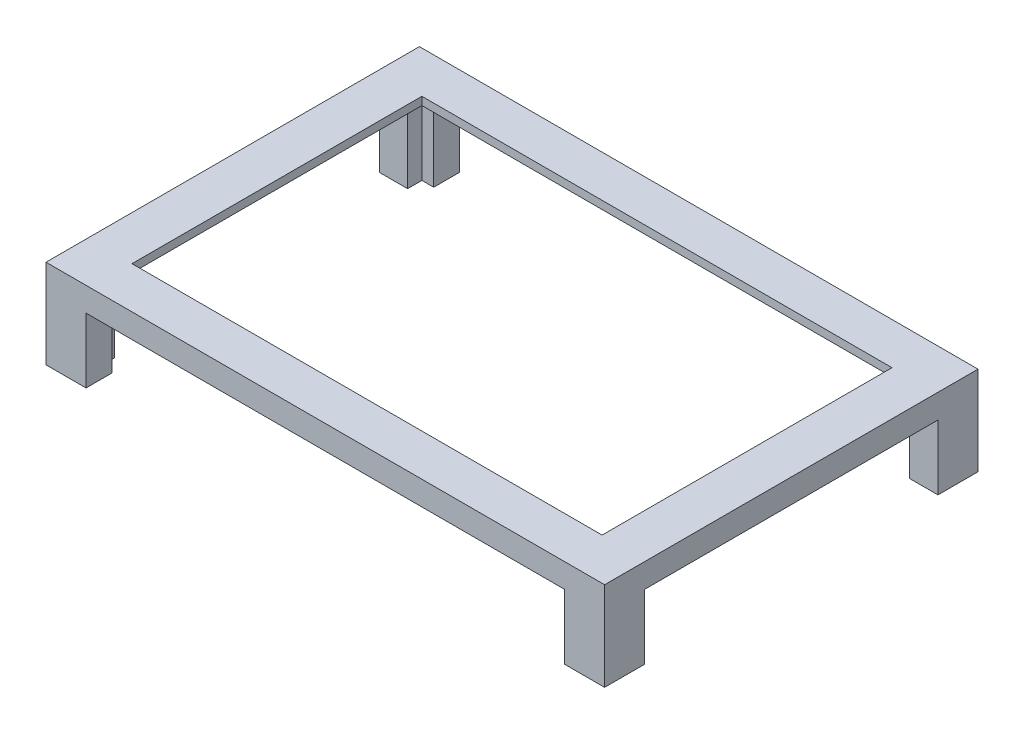
ISO-10303-21;
HEADER;
FILE_DESCRIPTION(('STEP AP214'),'2;1');
FILE_NAME('part.step','',(''),(''),'','','');
FILE_SCHEMA(('AUTOMOTIVE_DESIGN { 1 0 10303 214 1 1 1 1 }'));
ENDSEC;
DATA;
#1=APPLICATION_CONTEXT('core data for automotive mechanical design processes');
#2=APPLICATION_PROTOCOL_DEFINITION('international standard','automotive_design',2000,#1);
#3=PRODUCT_CONTEXT('',#1,'mechanical');
#4=PRODUCT('Part','Part','',(#3));
#5=PRODUCT_RELATED_PRODUCT_CATEGORY('part','',(#4));
#6=PRODUCT_DEFINITION_FORMATION('','',#4);
#7=PRODUCT_DEFINITION_CONTEXT('part definition',#1,'design');
#8=PRODUCT_DEFINITION('design','',#6,#7);
#9=PRODUCT_DEFINITION_SHAPE('','',#8);
#10=(LENGTH_UNIT() NAMED_UNIT(*) SI_UNIT(.MILLI.,.METRE.));
#11=(NAMED_UNIT(*) PLANE_ANGLE_UNIT() SI_UNIT($,.RADIAN.));
#12=(NAMED_UNIT(*) SI_UNIT($,.STERADIAN.) SOLID_ANGLE_UNIT());
#13=UNCERTAINTY_MEASURE_WITH_UNIT(LENGTH_MEASURE(1.E-05),#10,'distance_accuracy_value','');
#14=(GEOMETRIC_REPRESENTATION_CONTEXT(3) GLOBAL_UNCERTAINTY_ASSIGNED_CONTEXT((#13)) GLOBAL_UNIT_ASSIGNED_CONTEXT((#10,
#11,#12)) REPRESENTATION_CONTEXT('',''));
#15=CARTESIAN_POINT('',(0.,0.,0.));
#16=DIRECTION('',(0.,0.,1.));
#17=DIRECTION('',(1.,0.,0.));
#18=AXIS2_PLACEMENT_3D('',#15,#16,#17);
#19=CARTESIAN_POINT('',(0.,-28.194,0.));
#20=DIRECTION('',(0.,1.,0.));
#21=DIRECTION('',(0.,0.,1.));
#22=AXIS2_PLACEMENT_3D('',#19,#20,#21);
#23=PLANE('',#22);
#24=CARTESIAN_POINT('',(-4.8895,-28.194,-4.92125000000003));
#25=DIRECTION('',(0.,-1.,0.));
#26=DIRECTION('',(0.,0.,-1.));
#27=AXIS2_PLACEMENT_3D('',#24,#25,#26);
#28=CIRCLE('',#27,1.37795);
#29=CARTESIAN_POINT('',(-4.8895,-28.194,-6.29920000000003));
#30=VERTEX_POINT('',#29);
#31=EDGE_CURVE('E546',#30,#30,#28,.T.);
#32=ORIENTED_EDGE('',*,*,#31,.F.);
#33=EDGE_LOOP('',(#32));
#34=FACE_BOUND('',#33,.T.);
#35=DIRECTION('',(-1.,0.,0.));
#36=VECTOR('',#35,1.);
#37=CARTESIAN_POINT('',(0.,-28.194,-8.41375000000003));
#38=LINE('',#37,#36);
#39=CARTESIAN_POINT('',(3.4925,-28.194,-8.41375000000005));
#40=VERTEX_POINT('',#39);
#41=CARTESIAN_POINT('',(-9.2075,-28.194,-8.41375000000003));
#42=VERTEX_POINT('',#41);
#43=EDGE_CURVE('E260',#40,#42,#38,.T.);
#44=ORIENTED_EDGE('',*,*,#43,.F.);
#45=DIRECTION('',(0.,0.,1.));
#46=VECTOR('',#45,1.);
#47=CARTESIAN_POINT('',(3.4925,-28.194,-88.6142500000001));
#48=LINE('',#47,#46);
#49=CARTESIAN_POINT('',(3.4925,-28.194,-0.254000000000032));
#50=VERTEX_POINT('',#49);
#51=EDGE_CURVE('E354',#40,#50,#48,.T.);
#52=ORIENTED_EDGE('',*,*,#51,.T.);
#53=DIRECTION('',(1.,0.,0.));
#54=VECTOR('',#53,1.);
#55=CARTESIAN_POINT('',(0.,-28.194,-0.254));
#56=LINE('',#55,#54);
#57=CARTESIAN_POINT('',(-0.254,-28.194,-0.254));
#58=VERTEX_POINT('',#57);
#59=EDGE_CURVE('E265',#58,#50,#56,.T.);
#60=ORIENTED_EDGE('',*,*,#59,.F.);
#61=DIRECTION('',(0.,0.,1.));
#62=VECTOR('',#61,1.);
#63=CARTESIAN_POINT('',(-0.254,-28.194,0.));
#64=LINE('',#63,#62);
#65=CARTESIAN_POINT('',(-0.253999999999949,-28.194,4.28624999999997));
#66=VERTEX_POINT('',#65);
#67=EDGE_CURVE('E275',#58,#66,#64,.T.);
#68=ORIENTED_EDGE('',*,*,#67,.T.);
#69=DIRECTION('',(-1.,0.,0.));
#70=VECTOR('',#69,1.);
#71=CARTESIAN_POINT('',(0.,-28.194,4.28624999999997));
#72=LINE('',#71,#70);
#73=CARTESIAN_POINT('',(-9.2075,-28.194,4.28624999999997));
#74=VERTEX_POINT('',#73);
#75=EDGE_CURVE('E313',#66,#74,#72,.T.);
#76=ORIENTED_EDGE('',*,*,#75,.T.);
#77=DIRECTION('',(0.,0.,-1.));
#78=VECTOR('',#77,1.);
#79=CARTESIAN_POINT('',(-9.2075,-28.194,0.));
#80=LINE('',#79,#78);
#81=EDGE_CURVE('E253',#74,#42,#80,.T.);
#82=ORIENTED_EDGE('',*,*,#81,.T.);
#83=EDGE_LOOP('',(#44,#52,#60,#68,#76,#82));
#84=FACE_BOUND('',#83,.T.);
#85=ADVANCED_FACE('F39',(#34,#84),#23,.F.);
#86=CARTESIAN_POINT('',(-4.8895,-28.194,106.58475));
#87=DIRECTION('',(0.,-1.,0.));
#88=DIRECTION('',(0.,0.,-1.));
#89=AXIS2_PLACEMENT_3D('',#86,#87,#88);
#90=CIRCLE('',#89,1.37795);
#91=CARTESIAN_POINT('',(-4.8895,-28.194,105.2068));
#92=VERTEX_POINT('',#91);
#93=EDGE_CURVE('E549',#92,#92,#90,.T.);
#94=ORIENTED_EDGE('',*,*,#93,.F.);
#95=EDGE_LOOP('',(#94));
#96=FACE_BOUND('',#95,.T.);
#97=DIRECTION('',(1.,0.,0.));
#98=VECTOR('',#97,1.);
#99=CARTESIAN_POINT('',(0.,-28.194,101.854));
#100=LINE('',#99,#98);
#101=CARTESIAN_POINT('',(-0.254,-28.194,101.854));
#102=VERTEX_POINT('',#101);
#103=CARTESIAN_POINT('',(3.4925,-28.194,101.854));
#104=VERTEX_POINT('',#103);
#105=EDGE_CURVE('E243',#102,#104,#100,.T.);
#106=ORIENTED_EDGE('',*,*,#105,.T.);
#107=DIRECTION('',(0.,0.,1.));
#108=VECTOR('',#107,1.);
#109=CARTESIAN_POINT('',(3.4925,-28.194,0.));
#110=LINE('',#109,#108);
#111=CARTESIAN_POINT('',(3.4925,-28.194,110.01375));
#112=VERTEX_POINT('',#111);
#113=EDGE_CURVE('E11',#104,#112,#110,.T.);
#114=ORIENTED_EDGE('',*,*,#113,.T.);
#115=DIRECTION('',(-1.,0.,0.));
#116=VECTOR('',#115,1.);
#117=CARTESIAN_POINT('',(0.,-28.194,110.01375));
#118=LINE('',#117,#116);
#119=CARTESIAN_POINT('',(-9.2075,-28.194,110.01375));
#120=VERTEX_POINT('',#119);
#121=EDGE_CURVE('E240',#112,#120,#118,.T.);
#122=ORIENTED_EDGE('',*,*,#121,.T.);
#123=CARTESIAN_POINT('',(-9.2075,-28.194,97.31375));
#124=VERTEX_POINT('',#123);
#125=EDGE_CURVE('E249',#120,#124,#80,.T.);
#126=ORIENTED_EDGE('',*,*,#125,.T.);
#127=DIRECTION('',(1.,0.,0.));
#128=VECTOR('',#127,1.);
#129=CARTESIAN_POINT('',(0.,-28.194,97.31375));
#130=LINE('',#129,#128);
#131=CARTESIAN_POINT('',(-0.254,-28.194,97.31375));
#132=VERTEX_POINT('',#131);
#133=EDGE_CURVE('E312',#124,#132,#130,.T.);
#134=ORIENTED_EDGE('',*,*,#133,.T.);
#135=EDGE_CURVE('E274',#132,#102,#64,.T.);
#136=ORIENTED_EDGE('',*,*,#135,.T.);
#137=EDGE_LOOP('',(#106,#114,#122,#126,#134,#136));
#138=FACE_BOUND('',#137,.T.);
#139=ADVANCED_FACE('F238',(#96,#138),#23,.F.);
#140=CARTESIAN_POINT('',(163.7665,-28.194,-4.92125000000003));
#141=DIRECTION('',(0.,-1.,0.));
#142=DIRECTION('',(0.,0.,-1.));
#143=AXIS2_PLACEMENT_3D('',#140,#141,#142);
#144=CIRCLE('',#143,1.37795);
#145=CARTESIAN_POINT('',(163.7665,-28.194,-6.29920000000003));
#146=VERTEX_POINT('',#145);
#147=EDGE_CURVE('E540',#146,#146,#144,.T.);
#148=ORIENTED_EDGE('',*,*,#147,.F.);
#149=EDGE_LOOP('',(#148));
#150=FACE_BOUND('',#149,.T.);
#151=CARTESIAN_POINT('',(155.2575,-28.194,-0.254000000000032));
#152=VERTEX_POINT('',#151);
#153=CARTESIAN_POINT('',(159.004,-28.194,-0.254));
#154=VERTEX_POINT('',#153);
#155=EDGE_CURVE('E264',#152,#154,#56,.T.);
#156=ORIENTED_EDGE('',*,*,#155,.F.);
#157=DIRECTION('',(0.,0.,1.));
#158=VECTOR('',#157,1.);
#159=CARTESIAN_POINT('',(155.2575,-28.194,-88.6142500000001));
#160=LINE('',#159,#158);
#161=CARTESIAN_POINT('',(155.2575,-28.194,-8.41375000000005));
#162=VERTEX_POINT('',#161);
#163=EDGE_CURVE('E362',#162,#152,#160,.T.);
#164=ORIENTED_EDGE('',*,*,#163,.F.);
#165=CARTESIAN_POINT('',(167.9575,-28.194,-8.41375000000003));
#166=VERTEX_POINT('',#165);
#167=EDGE_CURVE('E261',#166,#162,#38,.T.);
#168=ORIENTED_EDGE('',*,*,#167,.F.);
#169=DIRECTION('',(0.,0.,-1.));
#170=VECTOR('',#169,1.);
#171=CARTESIAN_POINT('',(167.9575,-28.194,0.));
#172=LINE('',#171,#170);
#173=CARTESIAN_POINT('',(167.9575,-28.194,4.28624999999997));
#174=VERTEX_POINT('',#173);
#175=EDGE_CURVE('E252',#174,#166,#172,.T.);
#176=ORIENTED_EDGE('',*,*,#175,.F.);
#177=CARTESIAN_POINT('',(159.004,-28.194,4.28624999999997));
#178=VERTEX_POINT('',#177);
#179=EDGE_CURVE('E316',#174,#178,#72,.T.);
#180=ORIENTED_EDGE('',*,*,#179,.T.);
#181=DIRECTION('',(0.,0.,1.));
#182=VECTOR('',#181,1.);
#183=CARTESIAN_POINT('',(159.004,-28.194,0.));
#184=LINE('',#183,#182);
#185=EDGE_CURVE('E269',#154,#178,#184,.T.);
#186=ORIENTED_EDGE('',*,*,#185,.F.);
#187=EDGE_LOOP('',(#156,#164,#168,#176,#180,#186));
#188=FACE_BOUND('',#187,.T.);
#189=ADVANCED_FACE('F480',(#150,#188),#23,.F.);
#190=CARTESIAN_POINT('',(159.004,-28.194,0.));
#191=DIRECTION('',(-1.,0.,0.));
#192=DIRECTION('',(0.,0.,1.));
#193=AXIS2_PLACEMENT_3D('',#190,#191,#192);
#194=PLANE('',#193);
#195=DIRECTION('',(0.,-1.,0.));
#196=VECTOR('',#195,1.);
#197=CARTESIAN_POINT('',(159.004,-28.194,4.28624999999997));
#198=LINE('',#197,#196);
#199=CARTESIAN_POINT('',(159.004,-7.62,4.28624999999997));
#200=VERTEX_POINT('',#199);
#201=EDGE_CURVE('E407',#200,#178,#198,.T.);
#202=ORIENTED_EDGE('',*,*,#201,.F.);
#203=DIRECTION('',(0.,0.,-1.));
#204=VECTOR('',#203,1.);
#205=CARTESIAN_POINT('',(159.004,-7.62,0.));
#206=LINE('',#205,#204);
#207=CARTESIAN_POINT('',(159.004,-7.62,97.31375));
#208=VERTEX_POINT('',#207);
#209=EDGE_CURVE('E412',#208,#200,#206,.T.);
#210=ORIENTED_EDGE('',*,*,#209,.F.);
#211=DIRECTION('',(0.,1.,0.));
#212=VECTOR('',#211,1.);
#213=CARTESIAN_POINT('',(159.004,-28.194,97.31375));
#214=LINE('',#213,#212);
#215=CARTESIAN_POINT('',(159.004,-28.194,97.31375));
#216=VERTEX_POINT('',#215);
#217=EDGE_CURVE('E342',#216,#208,#214,.T.);
#218=ORIENTED_EDGE('',*,*,#217,.F.);
#219=CARTESIAN_POINT('',(159.004,-28.194,101.854));
#220=VERTEX_POINT('',#219);
#221=EDGE_CURVE('E268',#216,#220,#184,.T.);
#222=ORIENTED_EDGE('',*,*,#221,.T.);
#223=DIRECTION('',(0.,1.,0.));
#224=VECTOR('',#223,1.);
#225=CARTESIAN_POINT('',(159.004,-28.194,101.854));
#226=LINE('',#225,#224);
#227=CARTESIAN_POINT('',(159.004,-2.54,101.854));
#228=VERTEX_POINT('',#227);
#229=EDGE_CURVE('E297',#220,#228,#226,.T.);
#230=ORIENTED_EDGE('',*,*,#229,.T.);
#231=DIRECTION('',(0.,0.,-1.));
#232=VECTOR('',#231,1.);
#233=CARTESIAN_POINT('',(159.004,-2.54,4.826));
#234=LINE('',#233,#232);
#235=CARTESIAN_POINT('',(159.004,-2.54,-0.254));
#236=VERTEX_POINT('',#235);
#237=EDGE_CURVE('E339',#228,#236,#234,.T.);
#238=ORIENTED_EDGE('',*,*,#237,.T.);
#239=DIRECTION('',(0.,1.,0.));
#240=VECTOR('',#239,1.);
#241=CARTESIAN_POINT('',(159.004,-28.194,-0.254));
#242=LINE('',#241,#240);
#243=EDGE_CURVE('E300',#154,#236,#242,.T.);
#244=ORIENTED_EDGE('',*,*,#243,.F.);
#245=ORIENTED_EDGE('',*,*,#185,.T.);
#246=EDGE_LOOP('',(#202,#210,#218,#222,#230,#238,#244,#245));
#247=FACE_BOUND('',#246,.T.);
#248=ADVANCED_FACE('F337',(#247),#194,.T.);
#249=CARTESIAN_POINT('',(0.,-28.194,101.854));
#250=DIRECTION('',(0.,0.,1.));
#251=DIRECTION('',(1.,0.,0.));
#252=AXIS2_PLACEMENT_3D('',#249,#250,#251);
#253=PLANE('',#252);
#254=DIRECTION('',(-1.,0.,0.));
#255=VECTOR('',#254,1.);
#256=CARTESIAN_POINT('',(0.,-7.62,101.854));
#257=LINE('',#256,#255);
#258=CARTESIAN_POINT('',(155.2575,-7.62,101.854));
#259=VERTEX_POINT('',#258);
#260=CARTESIAN_POINT('',(3.4925,-7.62,101.854));
#261=VERTEX_POINT('',#260);
#262=EDGE_CURVE('E381',#259,#261,#257,.T.);
#263=ORIENTED_EDGE('',*,*,#262,.T.);
#264=DIRECTION('',(0.,-1.,0.));
#265=VECTOR('',#264,1.);
#266=CARTESIAN_POINT('',(3.4925,-28.194,101.854));
#267=LINE('',#266,#265);
#268=EDGE_CURVE('E375',#261,#104,#267,.T.);
#269=ORIENTED_EDGE('',*,*,#268,.T.);
#270=ORIENTED_EDGE('',*,*,#105,.F.);
#271=DIRECTION('',(0.,1.,0.));
#272=VECTOR('',#271,1.);
#273=CARTESIAN_POINT('',(-0.254,-28.194,101.854));
#274=LINE('',#273,#272);
#275=CARTESIAN_POINT('',(-0.254,-2.54,101.854));
#276=VERTEX_POINT('',#275);
#277=EDGE_CURVE('E294',#102,#276,#274,.T.);
#278=ORIENTED_EDGE('',*,*,#277,.T.);
#279=DIRECTION('',(-1.,0.,0.));
#280=VECTOR('',#279,1.);
#281=CARTESIAN_POINT('',(4.826,-2.54,101.854));
#282=LINE('',#281,#280);
#283=EDGE_CURVE('E333',#228,#276,#282,.T.);
#284=ORIENTED_EDGE('',*,*,#283,.F.);
#285=ORIENTED_EDGE('',*,*,#229,.F.);
#286=CARTESIAN_POINT('',(155.2575,-28.194,101.854));
#287=VERTEX_POINT('',#286);
#288=EDGE_CURVE('E272',#287,#220,#100,.T.);
#289=ORIENTED_EDGE('',*,*,#288,.F.);
#290=DIRECTION('',(0.,1.,0.));
#291=VECTOR('',#290,1.);
#292=CARTESIAN_POINT('',(155.2575,-28.194,101.854));
#293=LINE('',#292,#291);
#294=EDGE_CURVE('E62',#287,#259,#293,.T.);
#295=ORIENTED_EDGE('',*,*,#294,.T.);
#296=EDGE_LOOP('',(#263,#269,#270,#278,#284,#285,#289,#295));
#297=FACE_BOUND('',#296,.T.);
#298=ADVANCED_FACE('F330',(#297),#253,.F.);
#299=CARTESIAN_POINT('',(-0.254,-28.194,0.));
#300=DIRECTION('',(-1.,0.,0.));
#301=DIRECTION('',(0.,0.,1.));
#302=AXIS2_PLACEMENT_3D('',#299,#300,#301);
#303=PLANE('',#302);
#304=DIRECTION('',(0.,0.,-1.));
#305=VECTOR('',#304,1.);
#306=CARTESIAN_POINT('',(-0.254,-7.62,0.));
#307=LINE('',#306,#305);
#308=CARTESIAN_POINT('',(-0.253999999999949,-7.62,97.31375));
#309=VERTEX_POINT('',#308);
#310=CARTESIAN_POINT('',(-0.253999999999949,-7.62,4.28624999999997));
#311=VERTEX_POINT('',#310);
#312=EDGE_CURVE('E409',#309,#311,#307,.T.);
#313=ORIENTED_EDGE('',*,*,#312,.T.);
#314=DIRECTION('',(0.,-1.,0.));
#315=VECTOR('',#314,1.);
#316=CARTESIAN_POINT('',(-0.254,-28.194,4.28624999999997));
#317=LINE('',#316,#315);
#318=EDGE_CURVE('E404',#311,#66,#317,.T.);
#319=ORIENTED_EDGE('',*,*,#318,.T.);
#320=ORIENTED_EDGE('',*,*,#67,.F.);
#321=DIRECTION('',(0.,1.,0.));
#322=VECTOR('',#321,1.);
#323=CARTESIAN_POINT('',(-0.254,-28.194,-0.254));
#324=LINE('',#323,#322);
#325=CARTESIAN_POINT('',(-0.254,-2.54,-0.254));
#326=VERTEX_POINT('',#325);
#327=EDGE_CURVE('E290',#58,#326,#324,.T.);
#328=ORIENTED_EDGE('',*,*,#327,.T.);
#329=DIRECTION('',(0.,0.,-1.));
#330=VECTOR('',#329,1.);
#331=CARTESIAN_POINT('',(-0.254,-2.54,4.826));
#332=LINE('',#331,#330);
#333=EDGE_CURVE('E282',#276,#326,#332,.T.);
#334=ORIENTED_EDGE('',*,*,#333,.F.);
#335=ORIENTED_EDGE('',*,*,#277,.F.);
#336=ORIENTED_EDGE('',*,*,#135,.F.);
#337=DIRECTION('',(0.,1.,0.));
#338=VECTOR('',#337,1.);
#339=CARTESIAN_POINT('',(-0.254,-28.194,97.31375));
#340=LINE('',#339,#338);
#341=EDGE_CURVE('E398',#132,#309,#340,.T.);
#342=ORIENTED_EDGE('',*,*,#341,.T.);
#343=EDGE_LOOP('',(#313,#319,#320,#328,#334,#335,#336,#342));
#344=FACE_BOUND('',#343,.T.);
#345=ADVANCED_FACE('F457',(#344),#303,.F.);
#346=CARTESIAN_POINT('',(0.,-28.194,-0.254));
#347=DIRECTION('',(0.,0.,1.));
#348=DIRECTION('',(1.,0.,0.));
#349=AXIS2_PLACEMENT_3D('',#346,#347,#348);
#350=PLANE('',#349);
#351=DIRECTION('',(0.,-1.,0.));
#352=VECTOR('',#351,1.);
#353=CARTESIAN_POINT('',(3.4925,-28.194,-0.254));
#354=LINE('',#353,#352);
#355=CARTESIAN_POINT('',(3.4925,-7.62,-0.254000000000032));
#356=VERTEX_POINT('',#355);
#357=EDGE_CURVE('E373',#356,#50,#354,.T.);
#358=ORIENTED_EDGE('',*,*,#357,.F.);
#359=DIRECTION('',(-1.,0.,0.));
#360=VECTOR('',#359,1.);
#361=CARTESIAN_POINT('',(0.,-7.62,-0.254));
#362=LINE('',#361,#360);
#363=CARTESIAN_POINT('',(155.2575,-7.62,-0.254000000000032));
#364=VERTEX_POINT('',#363);
#365=EDGE_CURVE('E379',#364,#356,#362,.T.);
#366=ORIENTED_EDGE('',*,*,#365,.F.);
#367=DIRECTION('',(0.,1.,0.));
#368=VECTOR('',#367,1.);
#369=CARTESIAN_POINT('',(155.2575,-28.194,-0.254));
#370=LINE('',#369,#368);
#371=EDGE_CURVE('E368',#152,#364,#370,.T.);
#372=ORIENTED_EDGE('',*,*,#371,.F.);
#373=ORIENTED_EDGE('',*,*,#155,.T.);
#374=ORIENTED_EDGE('',*,*,#243,.T.);
#375=DIRECTION('',(1.,0.,0.));
#376=VECTOR('',#375,1.);
#377=CARTESIAN_POINT('',(-0.254,-2.54,-0.254));
#378=LINE('',#377,#376);
#379=EDGE_CURVE('E441',#326,#236,#378,.T.);
#380=ORIENTED_EDGE('',*,*,#379,.F.);
#381=ORIENTED_EDGE('',*,*,#327,.F.);
#382=ORIENTED_EDGE('',*,*,#59,.T.);
#383=EDGE_LOOP('',(#358,#366,#372,#373,#374,#380,#381,#382));
#384=FACE_BOUND('',#383,.T.);
#385=ADVANCED_FACE('F455',(#384),#350,.T.);
#386=CARTESIAN_POINT('',(-9.2075,-28.194,0.));
#387=DIRECTION('',(1.,0.,0.));
#388=DIRECTION('',(0.,0.,-1.));
#389=AXIS2_PLACEMENT_3D('',#386,#387,#388);
#390=PLANE('',#389);
#391=ORIENTED_EDGE('',*,*,#81,.F.);
#392=DIRECTION('',(0.,-1.,0.));
#393=VECTOR('',#392,1.);
#394=CARTESIAN_POINT('',(-9.2075,-7.62,4.28624999999997));
#395=LINE('',#394,#393);
#396=CARTESIAN_POINT('',(-9.2075,-7.62,4.28624999999997));
#397=VERTEX_POINT('',#396);
#398=EDGE_CURVE('E383',#397,#74,#395,.T.);
#399=ORIENTED_EDGE('',*,*,#398,.F.);
#400=DIRECTION('',(0.,0.,-1.));
#401=VECTOR('',#400,1.);
#402=CARTESIAN_POINT('',(-9.2075,-7.62,4.28624999999997));
#403=LINE('',#402,#401);
#404=CARTESIAN_POINT('',(-9.2075,-7.62,97.31375));
#405=VERTEX_POINT('',#404);
#406=EDGE_CURVE('E388',#405,#397,#403,.T.);
#407=ORIENTED_EDGE('',*,*,#406,.F.);
#408=DIRECTION('',(0.,1.,0.));
#409=VECTOR('',#408,1.);
#410=CARTESIAN_POINT('',(-9.2075,-7.62,97.31375));
#411=LINE('',#410,#409);
#412=EDGE_CURVE('E385',#124,#405,#411,.T.);
#413=ORIENTED_EDGE('',*,*,#412,.F.);
#414=ORIENTED_EDGE('',*,*,#125,.F.);
#415=DIRECTION('',(0.,1.,0.));
#416=VECTOR('',#415,1.);
#417=CARTESIAN_POINT('',(-9.2075,-28.194,110.01375));
#418=LINE('',#417,#416);
#419=CARTESIAN_POINT('',(-9.2075,0.,110.01375));
#420=VERTEX_POINT('',#419);
#421=EDGE_CURVE('E246',#120,#420,#418,.T.);
#422=ORIENTED_EDGE('',*,*,#421,.T.);
#423=DIRECTION('',(0.,0.,-1.));
#424=VECTOR('',#423,1.);
#425=CARTESIAN_POINT('',(-9.2075,0.,0.));
#426=LINE('',#425,#424);
#427=CARTESIAN_POINT('',(-9.2075,0.,-8.41375000000003));
#428=VERTEX_POINT('',#427);
#429=EDGE_CURVE('E278',#420,#428,#426,.T.);
#430=ORIENTED_EDGE('',*,*,#429,.T.);
#431=DIRECTION('',(0.,1.,0.));
#432=VECTOR('',#431,1.);
#433=CARTESIAN_POINT('',(-9.2075,-28.194,-8.41375000000003));
#434=LINE('',#433,#432);
#435=EDGE_CURVE('E303',#42,#428,#434,.T.);
#436=ORIENTED_EDGE('',*,*,#435,.F.);
#437=EDGE_LOOP('',(#391,#399,#407,#413,#414,#422,#430,#436));
#438=FACE_BOUND('',#437,.T.);
#439=ADVANCED_FACE('F41',(#438),#390,.F.);
#440=CARTESIAN_POINT('',(0.,-28.194,-8.41375000000003));
#441=DIRECTION('',(0.,0.,-1.));
#442=DIRECTION('',(-1.,0.,0.));
#443=AXIS2_PLACEMENT_3D('',#440,#441,#442);
#444=PLANE('',#443);
#445=DIRECTION('',(0.,1.,0.));
#446=VECTOR('',#445,1.);
#447=CARTESIAN_POINT('',(3.4925,-28.194,-8.41375000000003));
#448=LINE('',#447,#446);
#449=CARTESIAN_POINT('',(3.4925,-7.62,-8.41375000000005));
#450=VERTEX_POINT('',#449);
#451=EDGE_CURVE('E371',#40,#450,#448,.T.);
#452=ORIENTED_EDGE('',*,*,#451,.F.);
#453=ORIENTED_EDGE('',*,*,#43,.T.);
#454=ORIENTED_EDGE('',*,*,#435,.T.);
#455=DIRECTION('',(-1.,0.,0.));
#456=VECTOR('',#455,1.);
#457=CARTESIAN_POINT('',(0.,0.,-8.41375000000003));
#458=LINE('',#457,#456);
#459=CARTESIAN_POINT('',(167.9575,0.,-8.41375000000003));
#460=VERTEX_POINT('',#459);
#461=EDGE_CURVE('E287',#460,#428,#458,.T.);
#462=ORIENTED_EDGE('',*,*,#461,.F.);
#463=DIRECTION('',(0.,1.,0.));
#464=VECTOR('',#463,1.);
#465=CARTESIAN_POINT('',(167.9575,-28.194,-8.41375000000003));
#466=LINE('',#465,#464);
#467=EDGE_CURVE('E305',#166,#460,#466,.T.);
#468=ORIENTED_EDGE('',*,*,#467,.F.);
#469=ORIENTED_EDGE('',*,*,#167,.T.);
#470=DIRECTION('',(0.,-1.,0.));
#471=VECTOR('',#470,1.);
#472=CARTESIAN_POINT('',(155.2575,-28.194,-8.41375000000003));
#473=LINE('',#472,#471);
#474=CARTESIAN_POINT('',(155.2575,-7.62,-8.41375000000003));
#475=VERTEX_POINT('',#474);
#476=EDGE_CURVE('E366',#475,#162,#473,.T.);
#477=ORIENTED_EDGE('',*,*,#476,.F.);
#478=DIRECTION('',(1.,0.,0.));
#479=VECTOR('',#478,1.);
#480=CARTESIAN_POINT('',(0.,-7.62,-8.41375000000003));
#481=LINE('',#480,#479);
#482=EDGE_CURVE('E377',#450,#475,#481,.T.);
#483=ORIENTED_EDGE('',*,*,#482,.F.);
#484=EDGE_LOOP('',(#452,#453,#454,#462,#468,#469,#477,#483));
#485=FACE_BOUND('',#484,.T.);
#486=ADVANCED_FACE('F473',(#485),#444,.T.);
#487=CARTESIAN_POINT('',(167.9575,-28.194,0.));
#488=DIRECTION('',(1.,0.,0.));
#489=DIRECTION('',(0.,0.,-1.));
#490=AXIS2_PLACEMENT_3D('',#487,#488,#489);
#491=PLANE('',#490);
#492=DIRECTION('',(0.,1.,0.));
#493=VECTOR('',#492,1.);
#494=CARTESIAN_POINT('',(167.9575,-28.194,4.28624999999997));
#495=LINE('',#494,#493);
#496=CARTESIAN_POINT('',(167.9575,-7.62,4.28624999999997));
#497=VERTEX_POINT('',#496);
#498=EDGE_CURVE('E402',#174,#497,#495,.T.);
#499=ORIENTED_EDGE('',*,*,#498,.F.);
#500=ORIENTED_EDGE('',*,*,#175,.T.);
#501=ORIENTED_EDGE('',*,*,#467,.T.);
#502=DIRECTION('',(0.,0.,-1.));
#503=VECTOR('',#502,1.);
#504=CARTESIAN_POINT('',(167.9575,0.,0.));
#505=LINE('',#504,#503);
#506=CARTESIAN_POINT('',(167.9575,0.,110.01375));
#507=VERTEX_POINT('',#506);
#508=EDGE_CURVE('E284',#507,#460,#505,.T.);
#509=ORIENTED_EDGE('',*,*,#508,.F.);
#510=DIRECTION('',(0.,1.,0.));
#511=VECTOR('',#510,1.);
#512=CARTESIAN_POINT('',(167.9575,-28.194,110.01375));
#513=LINE('',#512,#511);
#514=CARTESIAN_POINT('',(167.9575,-28.194,110.01375));
#515=VERTEX_POINT('',#514);
#516=EDGE_CURVE('E307',#515,#507,#513,.T.);
#517=ORIENTED_EDGE('',*,*,#516,.F.);
#518=CARTESIAN_POINT('',(167.9575,-28.194,97.31375));
#519=VERTEX_POINT('',#518);
#520=EDGE_CURVE('E257',#515,#519,#172,.T.);
#521=ORIENTED_EDGE('',*,*,#520,.T.);
#522=DIRECTION('',(0.,-1.,0.));
#523=VECTOR('',#522,1.);
#524=CARTESIAN_POINT('',(167.9575,-28.194,97.31375));
#525=LINE('',#524,#523);
#526=CARTESIAN_POINT('',(167.9575,-7.62,97.31375));
#527=VERTEX_POINT('',#526);
#528=EDGE_CURVE('E349',#527,#519,#525,.T.);
#529=ORIENTED_EDGE('',*,*,#528,.F.);
#530=DIRECTION('',(0.,0.,1.));
#531=VECTOR('',#530,1.);
#532=CARTESIAN_POINT('',(167.9575,-7.62,0.));
#533=LINE('',#532,#531);
#534=EDGE_CURVE('E317',#497,#527,#533,.T.);
#535=ORIENTED_EDGE('',*,*,#534,.F.);
#536=EDGE_LOOP('',(#499,#500,#501,#509,#517,#521,#529,#535));
#537=FACE_BOUND('',#536,.T.);
#538=ADVANCED_FACE('F347',(#537),#491,.T.);
#539=CARTESIAN_POINT('',(0.,-28.194,110.01375));
#540=DIRECTION('',(0.,0.,-1.));
#541=DIRECTION('',(-1.,0.,0.));
#542=AXIS2_PLACEMENT_3D('',#539,#540,#541);
#543=PLANE('',#542);
#544=ORIENTED_EDGE('',*,*,#121,.F.);
#545=DIRECTION('',(0.,-1.,0.));
#546=VECTOR('',#545,1.);
#547=CARTESIAN_POINT('',(3.4925,-7.62,110.01375));
#548=LINE('',#547,#546);
#549=CARTESIAN_POINT('',(3.4925,-7.62,110.01375));
#550=VERTEX_POINT('',#549);
#551=EDGE_CURVE('E224',#550,#112,#548,.T.);
#552=ORIENTED_EDGE('',*,*,#551,.F.);
#553=DIRECTION('',(-1.,0.,0.));
#554=VECTOR('',#553,1.);
#555=CARTESIAN_POINT('',(3.4925,-7.62,110.01375));
#556=LINE('',#555,#554);
#557=CARTESIAN_POINT('',(155.2575,-7.62,110.01375));
#558=VERTEX_POINT('',#557);
#559=EDGE_CURVE('E352',#558,#550,#556,.T.);
#560=ORIENTED_EDGE('',*,*,#559,.F.);
#561=DIRECTION('',(0.,1.,0.));
#562=VECTOR('',#561,1.);
#563=CARTESIAN_POINT('',(155.2575,-7.62,110.01375));
#564=LINE('',#563,#562);
#565=CARTESIAN_POINT('',(155.2575,-28.194,110.01375));
#566=VERTEX_POINT('',#565);
#567=EDGE_CURVE('E233',#566,#558,#564,.T.);
#568=ORIENTED_EDGE('',*,*,#567,.F.);
#569=EDGE_CURVE('E248',#515,#566,#118,.T.);
#570=ORIENTED_EDGE('',*,*,#569,.F.);
#571=ORIENTED_EDGE('',*,*,#516,.T.);
#572=DIRECTION('',(-1.,0.,0.));
#573=VECTOR('',#572,1.);
#574=CARTESIAN_POINT('',(0.,0.,110.01375));
#575=LINE('',#574,#573);
#576=EDGE_CURVE('E281',#507,#420,#575,.T.);
#577=ORIENTED_EDGE('',*,*,#576,.T.);
#578=ORIENTED_EDGE('',*,*,#421,.F.);
#579=EDGE_LOOP('',(#544,#552,#560,#568,#570,#571,#577,#578));
#580=FACE_BOUND('',#579,.T.);
#581=ADVANCED_FACE('F244',(#580),#543,.F.);
#582=CARTESIAN_POINT('',(163.7665,-28.194,106.58475));
#583=DIRECTION('',(0.,-1.,0.));
#584=DIRECTION('',(0.,0.,-1.));
#585=AXIS2_PLACEMENT_3D('',#582,#583,#584);
#586=CIRCLE('',#585,1.37795);
#587=CARTESIAN_POINT('',(163.7665,-28.194,105.2068));
#588=VERTEX_POINT('',#587);
#589=EDGE_CURVE('E556',#588,#588,#586,.T.);
#590=ORIENTED_EDGE('',*,*,#589,.F.);
#591=EDGE_LOOP('',(#590));
#592=FACE_BOUND('',#591,.T.);
#593=ORIENTED_EDGE('',*,*,#569,.T.);
#594=DIRECTION('',(0.,0.,-1.));
#595=VECTOR('',#594,1.);
#596=CARTESIAN_POINT('',(155.2575,-28.194,0.));
#597=LINE('',#596,#595);
#598=EDGE_CURVE('E47',#566,#287,#597,.T.);
#599=ORIENTED_EDGE('',*,*,#598,.T.);
#600=ORIENTED_EDGE('',*,*,#288,.T.);
#601=ORIENTED_EDGE('',*,*,#221,.F.);
#602=EDGE_CURVE('E293',#216,#519,#130,.T.);
#603=ORIENTED_EDGE('',*,*,#602,.T.);
#604=ORIENTED_EDGE('',*,*,#520,.F.);
#605=EDGE_LOOP('',(#593,#599,#600,#601,#603,#604));
#606=FACE_BOUND('',#605,.T.);
#607=ADVANCED_FACE('F320',(#592,#606),#23,.F.);
#608=CARTESIAN_POINT('',(0.,0.,0.));
#609=DIRECTION('',(0.,1.,0.));
#610=DIRECTION('',(0.,0.,1.));
#611=AXIS2_PLACEMENT_3D('',#608,#609,#610);
#612=PLANE('',#611);
#613=DIRECTION('',(-1.,0.,0.));
#614=VECTOR('',#613,1.);
#615=CARTESIAN_POINT('',(-0.254,0.,4.826));
#616=LINE('',#615,#614);
#617=CARTESIAN_POINT('',(153.924,0.,4.826));
#618=VERTEX_POINT('',#617);
#619=CARTESIAN_POINT('',(4.826,0.,4.826));
#620=VERTEX_POINT('',#619);
#621=EDGE_CURVE('E444',#618,#620,#616,.T.);
#622=ORIENTED_EDGE('',*,*,#621,.F.);
#623=DIRECTION('',(0.,0.,-1.));
#624=VECTOR('',#623,1.);
#625=CARTESIAN_POINT('',(153.924,0.,4.826));
#626=LINE('',#625,#624);
#627=CARTESIAN_POINT('',(153.924,0.,96.774));
#628=VERTEX_POINT('',#627);
#629=EDGE_CURVE('E423',#628,#618,#626,.T.);
#630=ORIENTED_EDGE('',*,*,#629,.F.);
#631=DIRECTION('',(1.,0.,0.));
#632=VECTOR('',#631,1.);
#633=CARTESIAN_POINT('',(159.004,0.,96.774));
#634=LINE('',#633,#632);
#635=CARTESIAN_POINT('',(4.826,0.,96.774));
#636=VERTEX_POINT('',#635);
#637=EDGE_CURVE('E431',#636,#628,#634,.T.);
#638=ORIENTED_EDGE('',*,*,#637,.F.);
#639=DIRECTION('',(0.,0.,1.));
#640=VECTOR('',#639,1.);
#641=CARTESIAN_POINT('',(4.826,0.,101.854));
#642=LINE('',#641,#640);
#643=EDGE_CURVE('E438',#620,#636,#642,.T.);
#644=ORIENTED_EDGE('',*,*,#643,.F.);
#645=EDGE_LOOP('',(#622,#630,#638,#644));
#646=FACE_BOUND('',#645,.T.);
#647=ORIENTED_EDGE('',*,*,#429,.F.);
#648=ORIENTED_EDGE('',*,*,#576,.F.);
#649=ORIENTED_EDGE('',*,*,#508,.T.);
#650=ORIENTED_EDGE('',*,*,#461,.T.);
#651=EDGE_LOOP('',(#647,#648,#649,#650));
#652=FACE_BOUND('',#651,.T.);
#653=ADVANCED_FACE('F492',(#646,#652),#612,.T.);
#654=CARTESIAN_POINT('',(-0.254,-2.54,4.826));
#655=DIRECTION('',(0.,1.,0.));
#656=DIRECTION('',(0.,0.,1.));
#657=AXIS2_PLACEMENT_3D('',#654,#655,#656);
#658=PLANE('',#657);
#659=ORIENTED_EDGE('',*,*,#237,.F.);
#660=ORIENTED_EDGE('',*,*,#283,.T.);
#661=ORIENTED_EDGE('',*,*,#333,.T.);
#662=ORIENTED_EDGE('',*,*,#379,.T.);
#663=EDGE_LOOP('',(#659,#660,#661,#662));
#664=FACE_BOUND('',#663,.T.);
#665=DIRECTION('',(0.,0.,1.));
#666=VECTOR('',#665,1.);
#667=CARTESIAN_POINT('',(153.924,-2.54,4.826));
#668=LINE('',#667,#666);
#669=CARTESIAN_POINT('',(153.924,-2.54,4.826));
#670=VERTEX_POINT('',#669);
#671=CARTESIAN_POINT('',(153.924,-2.54,96.774));
#672=VERTEX_POINT('',#671);
#673=EDGE_CURVE('E417',#670,#672,#668,.T.);
#674=ORIENTED_EDGE('',*,*,#673,.F.);
#675=DIRECTION('',(1.,0.,0.));
#676=VECTOR('',#675,1.);
#677=CARTESIAN_POINT('',(-0.254,-2.54,4.826));
#678=LINE('',#677,#676);
#679=CARTESIAN_POINT('',(4.826,-2.54,4.826));
#680=VERTEX_POINT('',#679);
#681=EDGE_CURVE('E442',#680,#670,#678,.T.);
#682=ORIENTED_EDGE('',*,*,#681,.F.);
#683=DIRECTION('',(0.,0.,-1.));
#684=VECTOR('',#683,1.);
#685=CARTESIAN_POINT('',(4.826,-2.54,101.854));
#686=LINE('',#685,#684);
#687=CARTESIAN_POINT('',(4.826,-2.54,96.774));
#688=VERTEX_POINT('',#687);
#689=EDGE_CURVE('E433',#688,#680,#686,.T.);
#690=ORIENTED_EDGE('',*,*,#689,.F.);
#691=DIRECTION('',(-1.,0.,0.));
#692=VECTOR('',#691,1.);
#693=CARTESIAN_POINT('',(159.004,-2.54,96.774));
#694=LINE('',#693,#692);
#695=EDGE_CURVE('E426',#672,#688,#694,.T.);
#696=ORIENTED_EDGE('',*,*,#695,.F.);
#697=EDGE_LOOP('',(#674,#682,#690,#696));
#698=FACE_BOUND('',#697,.T.);
#699=ADVANCED_FACE('F449',(#664,#698),#658,.F.);
#700=CARTESIAN_POINT('',(0.,0.,4.826));
#701=DIRECTION('',(0.,0.,1.));
#702=DIRECTION('',(1.,0.,0.));
#703=AXIS2_PLACEMENT_3D('',#700,#701,#702);
#704=PLANE('',#703);
#705=DIRECTION('',(0.,-1.,0.));
#706=VECTOR('',#705,1.);
#707=CARTESIAN_POINT('',(153.924,0.,4.826));
#708=LINE('',#707,#706);
#709=EDGE_CURVE('E414',#618,#670,#708,.T.);
#710=ORIENTED_EDGE('',*,*,#709,.F.);
#711=ORIENTED_EDGE('',*,*,#621,.T.);
#712=DIRECTION('',(0.,1.,0.));
#713=VECTOR('',#712,1.);
#714=CARTESIAN_POINT('',(4.826,0.,4.826));
#715=LINE('',#714,#713);
#716=EDGE_CURVE('E435',#680,#620,#715,.T.);
#717=ORIENTED_EDGE('',*,*,#716,.F.);
#718=ORIENTED_EDGE('',*,*,#681,.T.);
#719=EDGE_LOOP('',(#710,#711,#717,#718));
#720=FACE_BOUND('',#719,.T.);
#721=ADVANCED_FACE('F627',(#720),#704,.T.);
#722=CARTESIAN_POINT('',(4.826,0.,0.));
#723=DIRECTION('',(1.,0.,0.));
#724=DIRECTION('',(0.,0.,-1.));
#725=AXIS2_PLACEMENT_3D('',#722,#723,#724);
#726=PLANE('',#725);
#727=DIRECTION('',(0.,1.,0.));
#728=VECTOR('',#727,1.);
#729=CARTESIAN_POINT('',(4.826,0.,96.774));
#730=LINE('',#729,#728);
#731=EDGE_CURVE('E428',#688,#636,#730,.T.);
#732=ORIENTED_EDGE('',*,*,#731,.F.);
#733=ORIENTED_EDGE('',*,*,#689,.T.);
#734=ORIENTED_EDGE('',*,*,#716,.T.);
#735=ORIENTED_EDGE('',*,*,#643,.T.);
#736=EDGE_LOOP('',(#732,#733,#734,#735));
#737=FACE_BOUND('',#736,.T.);
#738=ADVANCED_FACE('F623',(#737),#726,.T.);
#739=CARTESIAN_POINT('',(0.,0.,96.774));
#740=DIRECTION('',(0.,0.,-1.));
#741=DIRECTION('',(-1.,0.,0.));
#742=AXIS2_PLACEMENT_3D('',#739,#740,#741);
#743=PLANE('',#742);
#744=DIRECTION('',(0.,1.,0.));
#745=VECTOR('',#744,1.);
#746=CARTESIAN_POINT('',(153.924,0.,96.774));
#747=LINE('',#746,#745);
#748=EDGE_CURVE('E420',#672,#628,#747,.T.);
#749=ORIENTED_EDGE('',*,*,#748,.F.);
#750=ORIENTED_EDGE('',*,*,#695,.T.);
#751=ORIENTED_EDGE('',*,*,#731,.T.);
#752=ORIENTED_EDGE('',*,*,#637,.T.);
#753=EDGE_LOOP('',(#749,#750,#751,#752));
#754=FACE_BOUND('',#753,.T.);
#755=ADVANCED_FACE('F619',(#754),#743,.T.);
#756=CARTESIAN_POINT('',(153.924,0.,0.));
#757=DIRECTION('',(-1.,0.,0.));
#758=DIRECTION('',(0.,0.,1.));
#759=AXIS2_PLACEMENT_3D('',#756,#757,#758);
#760=PLANE('',#759);
#761=ORIENTED_EDGE('',*,*,#709,.T.);
#762=ORIENTED_EDGE('',*,*,#673,.T.);
#763=ORIENTED_EDGE('',*,*,#748,.T.);
#764=ORIENTED_EDGE('',*,*,#629,.T.);
#765=EDGE_LOOP('',(#761,#762,#763,#764));
#766=FACE_BOUND('',#765,.T.);
#767=ADVANCED_FACE('F615',(#766),#760,.T.);
#768=CARTESIAN_POINT('',(189.4205,-7.62,4.28624999999997));
#769=DIRECTION('',(0.,0.,-1.));
#770=DIRECTION('',(0.,1.,0.));
#771=AXIS2_PLACEMENT_3D('',#768,#769,#770);
#772=PLANE('',#771);
#773=ORIENTED_EDGE('',*,*,#201,.T.);
#774=ORIENTED_EDGE('',*,*,#179,.F.);
#775=ORIENTED_EDGE('',*,*,#498,.T.);
#776=DIRECTION('',(-1.,0.,0.));
#777=VECTOR('',#776,1.);
#778=CARTESIAN_POINT('',(189.4205,-7.62,4.28624999999997));
#779=LINE('',#778,#777);
#780=EDGE_CURVE('E394',#497,#200,#779,.T.);
#781=ORIENTED_EDGE('',*,*,#780,.T.);
#782=EDGE_LOOP('',(#773,#774,#775,#781));
#783=FACE_BOUND('',#782,.T.);
#784=ADVANCED_FACE('F486',(#783),#772,.F.);
#785=CARTESIAN_POINT('',(189.4205,-7.62,97.31375));
#786=DIRECTION('',(0.,0.,1.));
#787=DIRECTION('',(1.,0.,0.));
#788=AXIS2_PLACEMENT_3D('',#785,#786,#787);
#789=PLANE('',#788);
#790=ORIENTED_EDGE('',*,*,#217,.T.);
#791=DIRECTION('',(-1.,0.,0.));
#792=VECTOR('',#791,1.);
#793=CARTESIAN_POINT('',(189.4205,-7.62,97.31375));
#794=LINE('',#793,#792);
#795=EDGE_CURVE('E395',#527,#208,#794,.T.);
#796=ORIENTED_EDGE('',*,*,#795,.F.);
#797=ORIENTED_EDGE('',*,*,#528,.T.);
#798=ORIENTED_EDGE('',*,*,#602,.F.);
#799=EDGE_LOOP('',(#790,#796,#797,#798));
#800=FACE_BOUND('',#799,.T.);
#801=ADVANCED_FACE('F609',(#800),#789,.F.);
#802=CARTESIAN_POINT('',(189.4205,-7.62,4.28624999999997));
#803=DIRECTION('',(0.,1.,0.));
#804=DIRECTION('',(0.,0.,1.));
#805=AXIS2_PLACEMENT_3D('',#802,#803,#804);
#806=PLANE('',#805);
#807=ORIENTED_EDGE('',*,*,#209,.T.);
#808=ORIENTED_EDGE('',*,*,#780,.F.);
#809=ORIENTED_EDGE('',*,*,#534,.T.);
#810=ORIENTED_EDGE('',*,*,#795,.T.);
#811=EDGE_LOOP('',(#807,#808,#809,#810));
#812=FACE_BOUND('',#811,.T.);
#813=ADVANCED_FACE('F605',(#812),#806,.F.);
#814=EDGE_CURVE('E391',#309,#405,#794,.T.);
#815=ORIENTED_EDGE('',*,*,#814,.T.);
#816=ORIENTED_EDGE('',*,*,#406,.T.);
#817=EDGE_CURVE('E392',#311,#397,#779,.T.);
#818=ORIENTED_EDGE('',*,*,#817,.F.);
#819=ORIENTED_EDGE('',*,*,#312,.F.);
#820=EDGE_LOOP('',(#815,#816,#818,#819));
#821=FACE_BOUND('',#820,.T.);
#822=ADVANCED_FACE('F608',(#821),#806,.F.);
#823=ORIENTED_EDGE('',*,*,#817,.T.);
#824=ORIENTED_EDGE('',*,*,#398,.T.);
#825=ORIENTED_EDGE('',*,*,#75,.F.);
#826=ORIENTED_EDGE('',*,*,#318,.F.);
#827=EDGE_LOOP('',(#823,#824,#825,#826));
#828=FACE_BOUND('',#827,.T.);
#829=ADVANCED_FACE('F616',(#828),#772,.F.);
#830=ORIENTED_EDGE('',*,*,#133,.F.);
#831=ORIENTED_EDGE('',*,*,#412,.T.);
#832=ORIENTED_EDGE('',*,*,#814,.F.);
#833=ORIENTED_EDGE('',*,*,#341,.F.);
#834=EDGE_LOOP('',(#830,#831,#832,#833));
#835=FACE_BOUND('',#834,.T.);
#836=ADVANCED_FACE('F510',(#835),#789,.F.);
#837=CARTESIAN_POINT('',(3.4925,-7.62,-88.6142500000001));
#838=DIRECTION('',(-1.,0.,0.));
#839=DIRECTION('',(0.,-1.,0.));
#840=AXIS2_PLACEMENT_3D('',#837,#838,#839);
#841=PLANE('',#840);
#842=DIRECTION('',(0.,0.,1.));
#843=VECTOR('',#842,1.);
#844=CARTESIAN_POINT('',(3.4925,-7.62,-88.6142500000001));
#845=LINE('',#844,#843);
#846=EDGE_CURVE('E228',#261,#550,#845,.T.);
#847=ORIENTED_EDGE('',*,*,#846,.T.);
#848=ORIENTED_EDGE('',*,*,#551,.T.);
#849=ORIENTED_EDGE('',*,*,#113,.F.);
#850=ORIENTED_EDGE('',*,*,#268,.F.);
#851=EDGE_LOOP('',(#847,#848,#849,#850));
#852=FACE_BOUND('',#851,.T.);
#853=ADVANCED_FACE('F225',(#852),#841,.F.);
#854=CARTESIAN_POINT('',(155.2575,-7.62,-88.6142500000001));
#855=DIRECTION('',(1.,0.,0.));
#856=DIRECTION('',(0.,0.,-1.));
#857=AXIS2_PLACEMENT_3D('',#854,#855,#856);
#858=PLANE('',#857);
#859=ORIENTED_EDGE('',*,*,#598,.F.);
#860=ORIENTED_EDGE('',*,*,#567,.T.);
#861=DIRECTION('',(0.,0.,1.));
#862=VECTOR('',#861,1.);
#863=CARTESIAN_POINT('',(155.2575,-7.62,-88.6142500000001));
#864=LINE('',#863,#862);
#865=EDGE_CURVE('E360',#259,#558,#864,.T.);
#866=ORIENTED_EDGE('',*,*,#865,.F.);
#867=ORIENTED_EDGE('',*,*,#294,.F.);
#868=EDGE_LOOP('',(#859,#860,#866,#867));
#869=FACE_BOUND('',#868,.T.);
#870=ADVANCED_FACE('F502',(#869),#858,.F.);
#871=CARTESIAN_POINT('',(3.4925,-7.62,-88.6142500000001));
#872=DIRECTION('',(0.,1.,0.));
#873=DIRECTION('',(0.,0.,1.));
#874=AXIS2_PLACEMENT_3D('',#871,#872,#873);
#875=PLANE('',#874);
#876=ORIENTED_EDGE('',*,*,#865,.T.);
#877=ORIENTED_EDGE('',*,*,#559,.T.);
#878=ORIENTED_EDGE('',*,*,#846,.F.);
#879=ORIENTED_EDGE('',*,*,#262,.F.);
#880=EDGE_LOOP('',(#876,#877,#878,#879));
#881=FACE_BOUND('',#880,.T.);
#882=ADVANCED_FACE('F501',(#881),#875,.F.);
#883=ORIENTED_EDGE('',*,*,#357,.T.);
#884=ORIENTED_EDGE('',*,*,#51,.F.);
#885=ORIENTED_EDGE('',*,*,#451,.T.);
#886=EDGE_CURVE('E359',#450,#356,#845,.T.);
#887=ORIENTED_EDGE('',*,*,#886,.T.);
#888=EDGE_LOOP('',(#883,#884,#885,#887));
#889=FACE_BOUND('',#888,.T.);
#890=ADVANCED_FACE('F465',(#889),#841,.F.);
#891=ORIENTED_EDGE('',*,*,#365,.T.);
#892=ORIENTED_EDGE('',*,*,#886,.F.);
#893=ORIENTED_EDGE('',*,*,#482,.T.);
#894=EDGE_CURVE('E54',#475,#364,#864,.T.);
#895=ORIENTED_EDGE('',*,*,#894,.T.);
#896=EDGE_LOOP('',(#891,#892,#893,#895));
#897=FACE_BOUND('',#896,.T.);
#898=ADVANCED_FACE('F470',(#897),#875,.F.);
#899=ORIENTED_EDGE('',*,*,#371,.T.);
#900=ORIENTED_EDGE('',*,*,#894,.F.);
#901=ORIENTED_EDGE('',*,*,#476,.T.);
#902=ORIENTED_EDGE('',*,*,#163,.T.);
#903=EDGE_LOOP('',(#899,#900,#901,#902));
#904=FACE_BOUND('',#903,.T.);
#905=ADVANCED_FACE('F477',(#904),#858,.F.);
#906=CARTESIAN_POINT('',(163.7665,-15.494,106.58475));
#907=DIRECTION('',(0.,-1.,0.));
#908=DIRECTION('',(0.,0.,-1.));
#909=AXIS2_PLACEMENT_3D('',#906,#907,#908);
#910=CYLINDRICAL_SURFACE('',#909,1.37795);
#911=CARTESIAN_POINT('',(163.7665,-15.494,106.58475));
#912=DIRECTION('',(0.,-1.,0.));
#913=DIRECTION('',(0.,0.,-1.));
#914=AXIS2_PLACEMENT_3D('',#911,#912,#913);
#915=CIRCLE('',#914,1.37795);
#916=CARTESIAN_POINT('',(163.7665,-15.494,105.2068));
#917=VERTEX_POINT('',#916);
#918=EDGE_CURVE('E234',#917,#917,#915,.T.);
#919=ORIENTED_EDGE('',*,*,#918,.F.);
#920=EDGE_LOOP('',(#919));
#921=FACE_BOUND('',#920,.T.);
#922=ORIENTED_EDGE('',*,*,#589,.T.);
#923=EDGE_LOOP('',(#922));
#924=FACE_BOUND('',#923,.T.);
#925=ADVANCED_FACE('F513',(#921,#924),#910,.F.);
#926=CARTESIAN_POINT('',(163.7665,-15.494,106.58475));
#927=DIRECTION('',(0.,-1.,0.));
#928=DIRECTION('',(0.,0.,-1.));
#929=AXIS2_PLACEMENT_3D('',#926,#927,#928);
#930=PLANE('',#929);
#931=ORIENTED_EDGE('',*,*,#918,.T.);
#932=EDGE_LOOP('',(#931));
#933=FACE_BOUND('',#932,.T.);
#934=ADVANCED_FACE('F587',(#933),#930,.T.);
#935=CARTESIAN_POINT('',(163.7665,-15.494,-4.92125000000003));
#936=DIRECTION('',(0.,-1.,0.));
#937=DIRECTION('',(0.,0.,-1.));
#938=AXIS2_PLACEMENT_3D('',#935,#936,#937);
#939=CYLINDRICAL_SURFACE('',#938,1.37795);
#940=CARTESIAN_POINT('',(163.7665,-15.494,-4.92125000000003));
#941=DIRECTION('',(0.,-1.,0.));
#942=DIRECTION('',(0.,0.,-1.));
#943=AXIS2_PLACEMENT_3D('',#940,#941,#942);
#944=CIRCLE('',#943,1.37795);
#945=CARTESIAN_POINT('',(163.7665,-15.494,-6.29920000000003));
#946=VERTEX_POINT('',#945);
#947=EDGE_CURVE('E542',#946,#946,#944,.T.);
#948=ORIENTED_EDGE('',*,*,#947,.F.);
#949=EDGE_LOOP('',(#948));
#950=FACE_BOUND('',#949,.T.);
#951=ORIENTED_EDGE('',*,*,#147,.T.);
#952=EDGE_LOOP('',(#951));
#953=FACE_BOUND('',#952,.T.);
#954=ADVANCED_FACE('F584',(#950,#953),#939,.F.);
#955=CARTESIAN_POINT('',(163.7665,-15.494,-4.92125000000003));
#956=DIRECTION('',(0.,-1.,0.));
#957=DIRECTION('',(0.,0.,-1.));
#958=AXIS2_PLACEMENT_3D('',#955,#956,#957);
#959=PLANE('',#958);
#960=ORIENTED_EDGE('',*,*,#947,.T.);
#961=EDGE_LOOP('',(#960));
#962=FACE_BOUND('',#961,.T.);
#963=ADVANCED_FACE('F581',(#962),#959,.T.);
#964=CARTESIAN_POINT('',(-4.8895,-15.494,106.58475));
#965=DIRECTION('',(0.,-1.,0.));
#966=DIRECTION('',(0.,0.,-1.));
#967=AXIS2_PLACEMENT_3D('',#964,#965,#966);
#968=CYLINDRICAL_SURFACE('',#967,1.37795);
#969=CARTESIAN_POINT('',(-4.8895,-15.494,106.58475));
#970=DIRECTION('',(0.,-1.,0.));
#971=DIRECTION('',(0.,0.,-1.));
#972=AXIS2_PLACEMENT_3D('',#969,#970,#971);
#973=CIRCLE('',#972,1.37795);
#974=CARTESIAN_POINT('',(-4.8895,-15.494,105.2068));
#975=VERTEX_POINT('',#974);
#976=EDGE_CURVE('E543',#975,#975,#973,.T.);
#977=ORIENTED_EDGE('',*,*,#976,.F.);
#978=EDGE_LOOP('',(#977));
#979=FACE_BOUND('',#978,.T.);
#980=ORIENTED_EDGE('',*,*,#93,.T.);
#981=EDGE_LOOP('',(#980));
#982=FACE_BOUND('',#981,.T.);
#983=ADVANCED_FACE('F577',(#979,#982),#968,.F.);
#984=CARTESIAN_POINT('',(-4.8895,-15.494,106.58475));
#985=DIRECTION('',(0.,-1.,0.));
#986=DIRECTION('',(0.,0.,-1.));
#987=AXIS2_PLACEMENT_3D('',#984,#985,#986);
#988=PLANE('',#987);
#989=ORIENTED_EDGE('',*,*,#976,.T.);
#990=EDGE_LOOP('',(#989));
#991=FACE_BOUND('',#990,.T.);
#992=ADVANCED_FACE('F569',(#991),#988,.T.);
#993=CARTESIAN_POINT('',(-4.8895,-15.494,-4.92125000000003));
#994=DIRECTION('',(0.,-1.,0.));
#995=DIRECTION('',(0.,0.,-1.));
#996=AXIS2_PLACEMENT_3D('',#993,#994,#995);
#997=CYLINDRICAL_SURFACE('',#996,1.37795);
#998=CARTESIAN_POINT('',(-4.8895,-15.494,-4.92125000000003));
#999=DIRECTION('',(0.,-1.,0.));
#1000=DIRECTION('',(0.,0.,-1.));
#1001=AXIS2_PLACEMENT_3D('',#998,#999,#1000);
#1002=CIRCLE('',#1001,1.37795);
#1003=CARTESIAN_POINT('',(-4.8895,-15.494,-6.29920000000003));
#1004=VERTEX_POINT('',#1003);
#1005=EDGE_CURVE('E558',#1004,#1004,#1002,.T.);
#1006=ORIENTED_EDGE('',*,*,#1005,.F.);
#1007=EDGE_LOOP('',(#1006));
#1008=FACE_BOUND('',#1007,.T.);
#1009=ORIENTED_EDGE('',*,*,#31,.T.);
#1010=EDGE_LOOP('',(#1009));
#1011=FACE_BOUND('',#1010,.T.);
#1012=ADVANCED_FACE('F566',(#1008,#1011),#997,.F.);
#1013=CARTESIAN_POINT('',(-4.8895,-15.494,-4.92125000000003));
#1014=DIRECTION('',(0.,-1.,0.));
#1015=DIRECTION('',(0.,0.,-1.));
#1016=AXIS2_PLACEMENT_3D('',#1013,#1014,#1015);
#1017=PLANE('',#1016);
#1018=ORIENTED_EDGE('',*,*,#1005,.T.);
#1019=EDGE_LOOP('',(#1018));
#1020=FACE_BOUND('',#1019,.T.);
#1021=ADVANCED_FACE('F568',(#1020),#1017,.T.);
#1022=CLOSED_SHELL('',(#85,#139,#189,#248,#298,#345,#385,#439,#486,#538,#581,#607,#653,#699,
#721,#738,#755,#767,#784,#801,#813,#822,#829,#836,#853,#870,#882,#890,#898,#905,#925,#934,#954,
#963,#983,#992,#1012,#1021));
#1023=MANIFOLD_SOLID_BREP('B2',#1022);
#1024=ADVANCED_BREP_SHAPE_REPRESENTATION('',(#18,#1023),#14);
#1025=SHAPE_DEFINITION_REPRESENTATION(#9,#1024);
ENDSEC;
END-ISO-10303-21;
